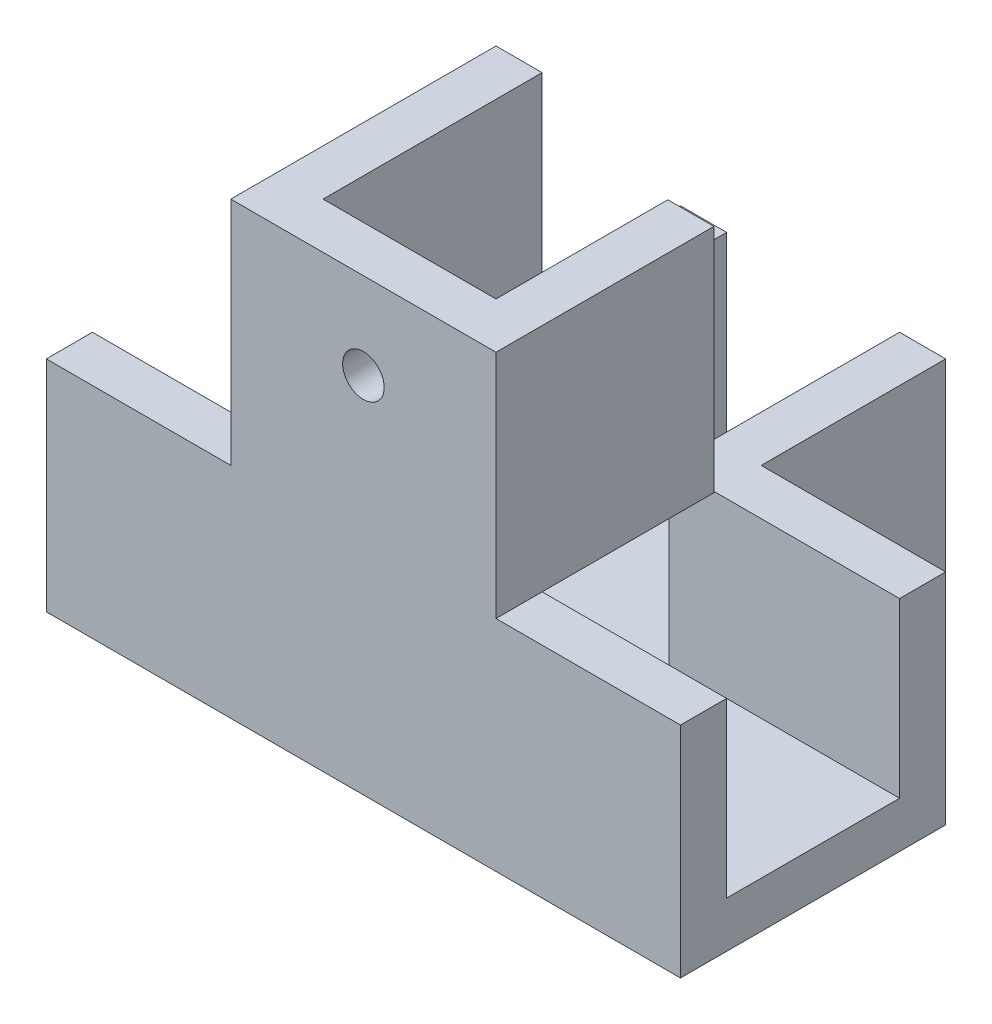
ISO-10303-21;
HEADER;
FILE_DESCRIPTION(('STEP AP214'),'2;1');
FILE_NAME('part.step','',(''),(''),'','','');
FILE_SCHEMA(('AUTOMOTIVE_DESIGN { 1 0 10303 214 1 1 1 1 }'));
ENDSEC;
DATA;
#1=APPLICATION_CONTEXT('core data for automotive mechanical design processes');
#2=APPLICATION_PROTOCOL_DEFINITION('international standard','automotive_design',2000,#1);
#3=PRODUCT_CONTEXT('',#1,'mechanical');
#4=PRODUCT('Part','Part','',(#3));
#5=PRODUCT_RELATED_PRODUCT_CATEGORY('part','',(#4));
#6=PRODUCT_DEFINITION_FORMATION('','',#4);
#7=PRODUCT_DEFINITION_CONTEXT('part definition',#1,'design');
#8=PRODUCT_DEFINITION('design','',#6,#7);
#9=PRODUCT_DEFINITION_SHAPE('','',#8);
#10=(LENGTH_UNIT() NAMED_UNIT(*) SI_UNIT(.MILLI.,.METRE.));
#11=(NAMED_UNIT(*) PLANE_ANGLE_UNIT() SI_UNIT($,.RADIAN.));
#12=(NAMED_UNIT(*) SI_UNIT($,.STERADIAN.) SOLID_ANGLE_UNIT());
#13=UNCERTAINTY_MEASURE_WITH_UNIT(LENGTH_MEASURE(1.E-05),#10,'distance_accuracy_value','');
#14=(GEOMETRIC_REPRESENTATION_CONTEXT(3) GLOBAL_UNCERTAINTY_ASSIGNED_CONTEXT((#13)) GLOBAL_UNIT_ASSIGNED_CONTEXT((#10,
#11,#12)) REPRESENTATION_CONTEXT('',''));
#15=CARTESIAN_POINT('',(0.,0.,0.));
#16=DIRECTION('',(0.,0.,1.));
#17=DIRECTION('',(1.,0.,0.));
#18=AXIS2_PLACEMENT_3D('',#15,#16,#17);
#19=CARTESIAN_POINT('',(0.,15.,0.));
#20=DIRECTION('',(0.,1.,0.));
#21=DIRECTION('',(0.,0.,1.));
#22=AXIS2_PLACEMENT_3D('',#19,#20,#21);
#23=PLANE('',#22);
#24=DIRECTION('',(1.,0.,0.));
#25=VECTOR('',#24,1.);
#26=CARTESIAN_POINT('',(0.,15.,-11.7755102040816));
#27=LINE('',#26,#25);
#28=CARTESIAN_POINT('',(-24.7551020408163,15.,-11.7755102040816));
#29=VERTEX_POINT('',#28);
#30=CARTESIAN_POINT('',(-8.75510204081633,15.,-11.7755102040816));
#31=VERTEX_POINT('',#30);
#32=EDGE_CURVE('E374',#29,#31,#27,.T.);
#33=ORIENTED_EDGE('',*,*,#32,.T.);
#34=DIRECTION('',(0.,0.,1.));
#35=VECTOR('',#34,1.);
#36=CARTESIAN_POINT('',(-8.75510204081633,15.,-15.7755102040816));
#37=LINE('',#36,#35);
#38=CARTESIAN_POINT('',(-8.75510204081633,15.,-15.7755102040816));
#39=VERTEX_POINT('',#38);
#40=EDGE_CURVE('E491',#39,#31,#37,.T.);
#41=ORIENTED_EDGE('',*,*,#40,.F.);
#42=DIRECTION('',(1.,0.,0.));
#43=VECTOR('',#42,1.);
#44=CARTESIAN_POINT('',(0.,15.,-15.7755102040816));
#45=LINE('',#44,#43);
#46=CARTESIAN_POINT('',(-24.7551020408163,15.,-15.7755102040816));
#47=VERTEX_POINT('',#46);
#48=EDGE_CURVE('E390',#47,#39,#45,.T.);
#49=ORIENTED_EDGE('',*,*,#48,.F.);
#50=DIRECTION('',(0.,0.,1.));
#51=VECTOR('',#50,1.);
#52=CARTESIAN_POINT('',(-24.7551020408163,15.,0.));
#53=LINE('',#52,#51);
#54=EDGE_CURVE('E394',#47,#29,#53,.T.);
#55=ORIENTED_EDGE('',*,*,#54,.T.);
#56=EDGE_LOOP('',(#33,#41,#49,#55));
#57=FACE_BOUND('',#56,.T.);
#58=ADVANCED_FACE('F41',(#57),#23,.T.);
#59=DIRECTION('',(0.,0.,-1.));
#60=VECTOR('',#59,1.);
#61=CARTESIAN_POINT('',(-8.75510204081633,15.,0.));
#62=LINE('',#61,#60);
#63=CARTESIAN_POINT('',(-8.75510204081633,15.,-31.7755102040816));
#64=VERTEX_POINT('',#63);
#65=EDGE_CURVE('E386',#39,#64,#62,.T.);
#66=ORIENTED_EDGE('',*,*,#65,.F.);
#67=DIRECTION('',(-1.,0.,0.));
#68=VECTOR('',#67,1.);
#69=CARTESIAN_POINT('',(-8.75510204081633,15.,-15.7755102040816));
#70=LINE('',#69,#68);
#71=CARTESIAN_POINT('',(-4.75510204081633,15.,-15.7755102040816));
#72=VERTEX_POINT('',#71);
#73=EDGE_CURVE('E236',#72,#39,#70,.T.);
#74=ORIENTED_EDGE('',*,*,#73,.F.);
#75=DIRECTION('',(0.,0.,-1.));
#76=VECTOR('',#75,1.);
#77=CARTESIAN_POINT('',(-4.75510204081633,15.,0.));
#78=LINE('',#77,#76);
#79=CARTESIAN_POINT('',(-4.75510204081633,15.,-31.7755102040816));
#80=VERTEX_POINT('',#79);
#81=EDGE_CURVE('E378',#72,#80,#78,.T.);
#82=ORIENTED_EDGE('',*,*,#81,.T.);
#83=DIRECTION('',(1.,0.,0.));
#84=VECTOR('',#83,1.);
#85=CARTESIAN_POINT('',(0.,15.,-31.7755102040816));
#86=LINE('',#85,#84);
#87=EDGE_CURVE('E382',#64,#80,#86,.T.);
#88=ORIENTED_EDGE('',*,*,#87,.F.);
#89=EDGE_LOOP('',(#66,#74,#82,#88));
#90=FACE_BOUND('',#89,.T.);
#91=ADVANCED_FACE('F446',(#90),#23,.T.);
#92=CARTESIAN_POINT('',(0.,15.,0.));
#93=DIRECTION('',(0.,1.,0.));
#94=DIRECTION('',(0.,0.,1.));
#95=AXIS2_PLACEMENT_3D('',#92,#93,#94);
#96=PLANE('',#95);
#97=DIRECTION('',(1.,0.,0.));
#98=VECTOR('',#97,1.);
#99=CARTESIAN_POINT('',(0.,15.,7.22448979591837));
#100=LINE('',#99,#98);
#101=CARTESIAN_POINT('',(-24.7551020408163,15.,7.22448979591837));
#102=VERTEX_POINT('',#101);
#103=CARTESIAN_POINT('',(-8.75510204081633,15.,7.22448979591837));
#104=VERTEX_POINT('',#103);
#105=EDGE_CURVE('E267',#102,#104,#100,.T.);
#106=ORIENTED_EDGE('',*,*,#105,.T.);
#107=DIRECTION('',(0.,0.,-1.));
#108=VECTOR('',#107,1.);
#109=CARTESIAN_POINT('',(-8.75510204081633,15.,0.));
#110=LINE('',#109,#108);
#111=CARTESIAN_POINT('',(-8.75510204081633,15.,3.22448979591837));
#112=VERTEX_POINT('',#111);
#113=EDGE_CURVE('E11',#104,#112,#110,.T.);
#114=ORIENTED_EDGE('',*,*,#113,.T.);
#115=DIRECTION('',(1.,0.,0.));
#116=VECTOR('',#115,1.);
#117=CARTESIAN_POINT('',(0.,15.,3.22448979591837));
#118=LINE('',#117,#116);
#119=CARTESIAN_POINT('',(-24.7551020408163,15.,3.22448979591837));
#120=VERTEX_POINT('',#119);
#121=EDGE_CURVE('E257',#120,#112,#118,.T.);
#122=ORIENTED_EDGE('',*,*,#121,.F.);
#123=DIRECTION('',(0.,0.,1.));
#124=VECTOR('',#123,1.);
#125=CARTESIAN_POINT('',(-24.7551020408163,15.,0.));
#126=LINE('',#125,#124);
#127=EDGE_CURVE('E261',#120,#102,#126,.T.);
#128=ORIENTED_EDGE('',*,*,#127,.T.);
#129=EDGE_LOOP('',(#106,#114,#122,#128));
#130=FACE_BOUND('',#129,.T.);
#131=ADVANCED_FACE('F597',(#130),#96,.T.);
#132=CARTESIAN_POINT('',(14.2448979591837,15.,3.22448979591837));
#133=VERTEX_POINT('',#132);
#134=CARTESIAN_POINT('',(30.2448979591837,15.,3.22448979591837));
#135=VERTEX_POINT('',#134);
#136=EDGE_CURVE('E256',#133,#135,#118,.T.);
#137=ORIENTED_EDGE('',*,*,#136,.F.);
#138=DIRECTION('',(0.,0.,-1.));
#139=VECTOR('',#138,1.);
#140=CARTESIAN_POINT('',(14.2448979591837,15.,-11.6755102040816));
#141=LINE('',#140,#139);
#142=CARTESIAN_POINT('',(14.2448979591837,15.,7.22448979591837));
#143=VERTEX_POINT('',#142);
#144=EDGE_CURVE('E485',#143,#133,#141,.T.);
#145=ORIENTED_EDGE('',*,*,#144,.F.);
#146=CARTESIAN_POINT('',(30.2448979591837,15.,7.22448979591837));
#147=VERTEX_POINT('',#146);
#148=EDGE_CURVE('E266',#143,#147,#100,.T.);
#149=ORIENTED_EDGE('',*,*,#148,.T.);
#150=DIRECTION('',(0.,0.,1.));
#151=VECTOR('',#150,1.);
#152=CARTESIAN_POINT('',(30.2448979591837,15.,0.));
#153=LINE('',#152,#151);
#154=EDGE_CURVE('E252',#135,#147,#153,.T.);
#155=ORIENTED_EDGE('',*,*,#154,.F.);
#156=EDGE_LOOP('',(#137,#145,#149,#155));
#157=FACE_BOUND('',#156,.T.);
#158=ADVANCED_FACE('F589',(#157),#96,.T.);
#159=CARTESIAN_POINT('',(0.,0.,0.));
#160=DIRECTION('',(0.,-1.,0.));
#161=DIRECTION('',(0.,0.,-1.));
#162=AXIS2_PLACEMENT_3D('',#159,#160,#161);
#163=PLANE('',#162);
#164=CARTESIAN_POINT('',(2.74489795918367,0.,-24.2755102040816));
#165=DIRECTION('',(0.,-1.,0.));
#166=DIRECTION('',(0.,0.,-1.));
#167=AXIS2_PLACEMENT_3D('',#164,#165,#166);
#168=CIRCLE('',#167,1.8);
#169=CARTESIAN_POINT('',(2.74489795918367,0.,-26.0755102040816));
#170=VERTEX_POINT('',#169);
#171=EDGE_CURVE('E510',#170,#170,#168,.T.);
#172=ORIENTED_EDGE('',*,*,#171,.T.);
#173=EDGE_LOOP('',(#172));
#174=FACE_BOUND('',#173,.T.);
#175=CARTESIAN_POINT('',(2.74489795918367,0.,-4.27551020408163));
#176=DIRECTION('',(0.,-1.,0.));
#177=DIRECTION('',(0.,0.,-1.));
#178=AXIS2_PLACEMENT_3D('',#175,#176,#177);
#179=CIRCLE('',#178,1.8);
#180=CARTESIAN_POINT('',(2.74489795918367,0.,-6.07551020408163));
#181=VERTEX_POINT('',#180);
#182=EDGE_CURVE('E514',#181,#181,#179,.T.);
#183=ORIENTED_EDGE('',*,*,#182,.T.);
#184=EDGE_LOOP('',(#183));
#185=FACE_BOUND('',#184,.T.);
#186=DIRECTION('',(0.,0.,-1.));
#187=VECTOR('',#186,1.);
#188=CARTESIAN_POINT('',(-24.7551020408163,0.,-15.7755102040816));
#189=LINE('',#188,#187);
#190=CARTESIAN_POINT('',(-24.7551020408163,0.,3.22448979591837));
#191=VERTEX_POINT('',#190);
#192=CARTESIAN_POINT('',(-24.7551020408163,0.,-11.7755102040816));
#193=VERTEX_POINT('',#192);
#194=EDGE_CURVE('E353',#191,#193,#189,.T.);
#195=ORIENTED_EDGE('',*,*,#194,.F.);
#196=DIRECTION('',(1.,0.,0.));
#197=VECTOR('',#196,1.);
#198=CARTESIAN_POINT('',(0.,0.,3.22448979591837));
#199=LINE('',#198,#197);
#200=CARTESIAN_POINT('',(30.2448979591837,0.,3.22448979591837));
#201=VERTEX_POINT('',#200);
#202=EDGE_CURVE('E246',#191,#201,#199,.T.);
#203=ORIENTED_EDGE('',*,*,#202,.T.);
#204=DIRECTION('',(0.,0.,1.));
#205=VECTOR('',#204,1.);
#206=CARTESIAN_POINT('',(30.2448979591837,0.,-15.7755102040816));
#207=LINE('',#206,#205);
#208=CARTESIAN_POINT('',(30.2448979591837,0.,-11.7755102040816));
#209=VERTEX_POINT('',#208);
#210=EDGE_CURVE('E319',#209,#201,#207,.T.);
#211=ORIENTED_EDGE('',*,*,#210,.F.);
#212=DIRECTION('',(1.,0.,0.));
#213=VECTOR('',#212,1.);
#214=CARTESIAN_POINT('',(0.,0.,-11.7755102040816));
#215=LINE('',#214,#213);
#216=CARTESIAN_POINT('',(10.2448979591837,0.,-11.7755102040816));
#217=VERTEX_POINT('',#216);
#218=EDGE_CURVE('E279',#217,#209,#215,.T.);
#219=ORIENTED_EDGE('',*,*,#218,.F.);
#220=DIRECTION('',(0.,0.,-1.));
#221=VECTOR('',#220,1.);
#222=CARTESIAN_POINT('',(10.2448979591837,0.,0.));
#223=LINE('',#222,#221);
#224=CARTESIAN_POINT('',(10.2448979591837,0.,-31.7755102040816));
#225=VERTEX_POINT('',#224);
#226=EDGE_CURVE('E284',#217,#225,#223,.T.);
#227=ORIENTED_EDGE('',*,*,#226,.T.);
#228=DIRECTION('',(1.,0.,0.));
#229=VECTOR('',#228,1.);
#230=CARTESIAN_POINT('',(14.2448979591837,0.,-31.7755102040816));
#231=LINE('',#230,#229);
#232=CARTESIAN_POINT('',(-4.75510204081633,0.,-31.7755102040816));
#233=VERTEX_POINT('',#232);
#234=EDGE_CURVE('E325',#233,#225,#231,.T.);
#235=ORIENTED_EDGE('',*,*,#234,.F.);
#236=DIRECTION('',(0.,0.,-1.));
#237=VECTOR('',#236,1.);
#238=CARTESIAN_POINT('',(-4.75510204081633,0.,0.));
#239=LINE('',#238,#237);
#240=CARTESIAN_POINT('',(-4.75510204081633,0.,-11.7755102040816));
#241=VERTEX_POINT('',#240);
#242=EDGE_CURVE('E379',#241,#233,#239,.T.);
#243=ORIENTED_EDGE('',*,*,#242,.F.);
#244=DIRECTION('',(1.,0.,0.));
#245=VECTOR('',#244,1.);
#246=CARTESIAN_POINT('',(0.,0.,-11.7755102040816));
#247=LINE('',#246,#245);
#248=EDGE_CURVE('E373',#193,#241,#247,.T.);
#249=ORIENTED_EDGE('',*,*,#248,.F.);
#250=EDGE_LOOP('',(#195,#203,#211,#219,#227,#235,#243,#249));
#251=FACE_BOUND('',#250,.T.);
#252=ADVANCED_FACE('F436',(#174,#185,#251),#163,.F.);
#253=CARTESIAN_POINT('',(0.,15.,-11.7755102040816));
#254=DIRECTION('',(0.,0.,-1.));
#255=DIRECTION('',(-1.,0.,0.));
#256=AXIS2_PLACEMENT_3D('',#253,#254,#255);
#257=PLANE('',#256);
#258=ORIENTED_EDGE('',*,*,#248,.T.);
#259=DIRECTION('',(0.,-1.,0.));
#260=VECTOR('',#259,1.);
#261=CARTESIAN_POINT('',(-4.75510204081633,15.,-11.7755102040816));
#262=LINE('',#261,#260);
#263=CARTESIAN_POINT('',(-4.75510204081633,15.,-11.7755102040816));
#264=VERTEX_POINT('',#263);
#265=EDGE_CURVE('E51',#264,#241,#262,.T.);
#266=ORIENTED_EDGE('',*,*,#265,.F.);
#267=DIRECTION('',(1.,0.,0.));
#268=VECTOR('',#267,1.);
#269=CARTESIAN_POINT('',(0.,15.,-11.7755102040816));
#270=LINE('',#269,#268);
#271=EDGE_CURVE('E242',#31,#264,#270,.T.);
#272=ORIENTED_EDGE('',*,*,#271,.F.);
#273=ORIENTED_EDGE('',*,*,#32,.F.);
#274=DIRECTION('',(0.,-1.,0.));
#275=VECTOR('',#274,1.);
#276=CARTESIAN_POINT('',(-24.7551020408163,15.,-11.7755102040816));
#277=LINE('',#276,#275);
#278=EDGE_CURVE('E397',#29,#193,#277,.T.);
#279=ORIENTED_EDGE('',*,*,#278,.T.);
#280=EDGE_LOOP('',(#258,#266,#272,#273,#279));
#281=FACE_BOUND('',#280,.T.);
#282=ADVANCED_FACE('F43',(#281),#257,.F.);
#283=CARTESIAN_POINT('',(-4.75510204081633,15.,0.));
#284=DIRECTION('',(-1.,0.,0.));
#285=DIRECTION('',(0.,0.,1.));
#286=AXIS2_PLACEMENT_3D('',#283,#284,#285);
#287=PLANE('',#286);
#288=ORIENTED_EDGE('',*,*,#242,.T.);
#289=DIRECTION('',(0.,-1.,0.));
#290=VECTOR('',#289,1.);
#291=CARTESIAN_POINT('',(-4.75510204081633,15.,-31.7755102040816));
#292=LINE('',#291,#290);
#293=EDGE_CURVE('E416',#80,#233,#292,.T.);
#294=ORIENTED_EDGE('',*,*,#293,.F.);
#295=ORIENTED_EDGE('',*,*,#81,.F.);
#296=DIRECTION('',(0.,-1.,0.));
#297=VECTOR('',#296,1.);
#298=CARTESIAN_POINT('',(-4.75510204081633,35.,-15.7755102040816));
#299=LINE('',#298,#297);
#300=CARTESIAN_POINT('',(-4.75510204081633,35.,-15.7755102040816));
#301=VERTEX_POINT('',#300);
#302=EDGE_CURVE('E58',#301,#72,#299,.T.);
#303=ORIENTED_EDGE('',*,*,#302,.F.);
#304=DIRECTION('',(0.,0.,-1.));
#305=VECTOR('',#304,1.);
#306=CARTESIAN_POINT('',(-4.75510204081633,35.,-15.7755102040816));
#307=LINE('',#306,#305);
#308=CARTESIAN_POINT('',(-4.75510204081632,35.,3.22448979591837));
#309=VERTEX_POINT('',#308);
#310=EDGE_CURVE('E497',#309,#301,#307,.T.);
#311=ORIENTED_EDGE('',*,*,#310,.F.);
#312=DIRECTION('',(0.,-1.,0.));
#313=VECTOR('',#312,1.);
#314=CARTESIAN_POINT('',(-4.75510204081632,35.,3.22448979591837));
#315=LINE('',#314,#313);
#316=CARTESIAN_POINT('',(-4.75510204081632,15.,3.22448979591837));
#317=VERTEX_POINT('',#316);
#318=EDGE_CURVE('E459',#309,#317,#315,.T.);
#319=ORIENTED_EDGE('',*,*,#318,.T.);
#320=DIRECTION('',(0.,0.,-1.));
#321=VECTOR('',#320,1.);
#322=CARTESIAN_POINT('',(-4.75510204081633,15.,-15.7755102040816));
#323=LINE('',#322,#321);
#324=EDGE_CURVE('E428',#317,#264,#323,.T.);
#325=ORIENTED_EDGE('',*,*,#324,.T.);
#326=ORIENTED_EDGE('',*,*,#265,.T.);
#327=EDGE_LOOP('',(#288,#294,#295,#303,#311,#319,#325,#326));
#328=FACE_BOUND('',#327,.T.);
#329=ADVANCED_FACE('F425',(#328),#287,.F.);
#330=CARTESIAN_POINT('',(0.,15.,-31.7755102040816));
#331=DIRECTION('',(0.,0.,-1.));
#332=DIRECTION('',(-1.,0.,0.));
#333=AXIS2_PLACEMENT_3D('',#330,#331,#332);
#334=PLANE('',#333);
#335=ORIENTED_EDGE('',*,*,#293,.T.);
#336=ORIENTED_EDGE('',*,*,#234,.T.);
#337=DIRECTION('',(0.,-1.,0.));
#338=VECTOR('',#337,1.);
#339=CARTESIAN_POINT('',(10.2448979591837,15.,-31.7755102040816));
#340=LINE('',#339,#338);
#341=CARTESIAN_POINT('',(10.2448979591837,15.,-31.7755102040816));
#342=VERTEX_POINT('',#341);
#343=EDGE_CURVE('E313',#342,#225,#340,.T.);
#344=ORIENTED_EDGE('',*,*,#343,.F.);
#345=DIRECTION('',(1.,0.,0.));
#346=VECTOR('',#345,1.);
#347=CARTESIAN_POINT('',(0.,15.,-31.7755102040816));
#348=LINE('',#347,#346);
#349=CARTESIAN_POINT('',(14.2448979591837,15.,-31.7755102040816));
#350=VERTEX_POINT('',#349);
#351=EDGE_CURVE('E296',#342,#350,#348,.T.);
#352=ORIENTED_EDGE('',*,*,#351,.T.);
#353=DIRECTION('',(0.,1.,0.));
#354=VECTOR('',#353,1.);
#355=CARTESIAN_POINT('',(14.2448979591837,-4.,-31.7755102040816));
#356=LINE('',#355,#354);
#357=CARTESIAN_POINT('',(14.2448979591837,-4.,-31.7755102040816));
#358=VERTEX_POINT('',#357);
#359=EDGE_CURVE('E364',#358,#350,#356,.T.);
#360=ORIENTED_EDGE('',*,*,#359,.F.);
#361=DIRECTION('',(1.,0.,0.));
#362=VECTOR('',#361,1.);
#363=CARTESIAN_POINT('',(14.2448979591837,-4.,-31.7755102040816));
#364=LINE('',#363,#362);
#365=CARTESIAN_POINT('',(-8.75510204081633,-4.,-31.7755102040816));
#366=VERTEX_POINT('',#365);
#367=EDGE_CURVE('E340',#366,#358,#364,.T.);
#368=ORIENTED_EDGE('',*,*,#367,.F.);
#369=DIRECTION('',(0.,-1.,0.));
#370=VECTOR('',#369,1.);
#371=CARTESIAN_POINT('',(-8.75510204081633,15.,-31.7755102040816));
#372=LINE('',#371,#370);
#373=EDGE_CURVE('E413',#64,#366,#372,.T.);
#374=ORIENTED_EDGE('',*,*,#373,.F.);
#375=ORIENTED_EDGE('',*,*,#87,.T.);
#376=EDGE_LOOP('',(#335,#336,#344,#352,#360,#368,#374,#375));
#377=FACE_BOUND('',#376,.T.);
#378=ADVANCED_FACE('F440',(#377),#334,.T.);
#379=CARTESIAN_POINT('',(-8.75510204081633,15.,0.));
#380=DIRECTION('',(-1.,0.,0.));
#381=DIRECTION('',(0.,0.,1.));
#382=AXIS2_PLACEMENT_3D('',#379,#380,#381);
#383=PLANE('',#382);
#384=ORIENTED_EDGE('',*,*,#373,.T.);
#385=DIRECTION('',(0.,0.,-1.));
#386=VECTOR('',#385,1.);
#387=CARTESIAN_POINT('',(-8.75510204081633,-4.,-31.7755102040816));
#388=LINE('',#387,#386);
#389=CARTESIAN_POINT('',(-8.75510204081633,-4.,-15.7755102040816));
#390=VERTEX_POINT('',#389);
#391=EDGE_CURVE('E336',#390,#366,#388,.T.);
#392=ORIENTED_EDGE('',*,*,#391,.F.);
#393=DIRECTION('',(0.,-1.,0.));
#394=VECTOR('',#393,1.);
#395=CARTESIAN_POINT('',(-8.75510204081633,15.,-15.7755102040816));
#396=LINE('',#395,#394);
#397=EDGE_CURVE('E410',#39,#390,#396,.T.);
#398=ORIENTED_EDGE('',*,*,#397,.F.);
#399=ORIENTED_EDGE('',*,*,#65,.T.);
#400=EDGE_LOOP('',(#384,#392,#398,#399));
#401=FACE_BOUND('',#400,.T.);
#402=ADVANCED_FACE('F574',(#401),#383,.T.);
#403=CARTESIAN_POINT('',(0.,15.,-15.7755102040816));
#404=DIRECTION('',(0.,0.,-1.));
#405=DIRECTION('',(-1.,0.,0.));
#406=AXIS2_PLACEMENT_3D('',#403,#404,#405);
#407=PLANE('',#406);
#408=ORIENTED_EDGE('',*,*,#397,.T.);
#409=DIRECTION('',(1.,0.,0.));
#410=VECTOR('',#409,1.);
#411=CARTESIAN_POINT('',(-8.75510204081633,-4.,-15.7755102040816));
#412=LINE('',#411,#410);
#413=CARTESIAN_POINT('',(-24.7551020408163,-4.,-15.7755102040816));
#414=VERTEX_POINT('',#413);
#415=EDGE_CURVE('E332',#414,#390,#412,.T.);
#416=ORIENTED_EDGE('',*,*,#415,.F.);
#417=DIRECTION('',(0.,-1.,0.));
#418=VECTOR('',#417,1.);
#419=CARTESIAN_POINT('',(-24.7551020408163,15.,-15.7755102040816));
#420=LINE('',#419,#418);
#421=EDGE_CURVE('E407',#47,#414,#420,.T.);
#422=ORIENTED_EDGE('',*,*,#421,.F.);
#423=ORIENTED_EDGE('',*,*,#48,.T.);
#424=EDGE_LOOP('',(#408,#416,#422,#423));
#425=FACE_BOUND('',#424,.T.);
#426=ADVANCED_FACE('F576',(#425),#407,.T.);
#427=CARTESIAN_POINT('',(-24.7551020408163,15.,0.));
#428=DIRECTION('',(1.,0.,0.));
#429=DIRECTION('',(0.,0.,-1.));
#430=AXIS2_PLACEMENT_3D('',#427,#428,#429);
#431=PLANE('',#430);
#432=ORIENTED_EDGE('',*,*,#421,.T.);
#433=DIRECTION('',(0.,0.,-1.));
#434=VECTOR('',#433,1.);
#435=CARTESIAN_POINT('',(-24.7551020408163,-4.,-15.7755102040816));
#436=LINE('',#435,#434);
#437=CARTESIAN_POINT('',(-24.7551020408163,-4.,7.22448979591837));
#438=VERTEX_POINT('',#437);
#439=EDGE_CURVE('E328',#438,#414,#436,.T.);
#440=ORIENTED_EDGE('',*,*,#439,.F.);
#441=DIRECTION('',(0.,1.,0.));
#442=VECTOR('',#441,1.);
#443=CARTESIAN_POINT('',(-24.7551020408163,-4.,7.22448979591837));
#444=LINE('',#443,#442);
#445=EDGE_CURVE('E367',#438,#102,#444,.T.);
#446=ORIENTED_EDGE('',*,*,#445,.T.);
#447=ORIENTED_EDGE('',*,*,#127,.F.);
#448=DIRECTION('',(0.,-1.,0.));
#449=VECTOR('',#448,1.);
#450=CARTESIAN_POINT('',(-24.7551020408163,15.,3.22448979591837));
#451=LINE('',#450,#449);
#452=EDGE_CURVE('E270',#120,#191,#451,.T.);
#453=ORIENTED_EDGE('',*,*,#452,.T.);
#454=ORIENTED_EDGE('',*,*,#194,.T.);
#455=ORIENTED_EDGE('',*,*,#278,.F.);
#456=ORIENTED_EDGE('',*,*,#54,.F.);
#457=EDGE_LOOP('',(#432,#440,#446,#447,#453,#454,#455,#456));
#458=FACE_BOUND('',#457,.T.);
#459=ADVANCED_FACE('F601',(#458),#431,.F.);
#460=CARTESIAN_POINT('',(30.2448979591837,-4.,-15.7755102040816));
#461=DIRECTION('',(-1.,0.,0.));
#462=DIRECTION('',(0.,0.,1.));
#463=AXIS2_PLACEMENT_3D('',#460,#461,#462);
#464=PLANE('',#463);
#465=DIRECTION('',(0.,1.,0.));
#466=VECTOR('',#465,1.);
#467=CARTESIAN_POINT('',(30.2448979591837,-4.,-15.7755102040816));
#468=LINE('',#467,#466);
#469=CARTESIAN_POINT('',(30.2448979591837,-4.,-15.7755102040816));
#470=VERTEX_POINT('',#469);
#471=CARTESIAN_POINT('',(30.2448979591837,15.,-15.7755102040816));
#472=VERTEX_POINT('',#471);
#473=EDGE_CURVE('E349',#470,#472,#468,.T.);
#474=ORIENTED_EDGE('',*,*,#473,.T.);
#475=DIRECTION('',(0.,0.,1.));
#476=VECTOR('',#475,1.);
#477=CARTESIAN_POINT('',(30.2448979591837,15.,0.));
#478=LINE('',#477,#476);
#479=CARTESIAN_POINT('',(30.2448979591837,15.,-11.7755102040816));
#480=VERTEX_POINT('',#479);
#481=EDGE_CURVE('E283',#472,#480,#478,.T.);
#482=ORIENTED_EDGE('',*,*,#481,.T.);
#483=DIRECTION('',(0.,-1.,0.));
#484=VECTOR('',#483,1.);
#485=CARTESIAN_POINT('',(30.2448979591837,15.,-11.7755102040816));
#486=LINE('',#485,#484);
#487=EDGE_CURVE('E316',#480,#209,#486,.T.);
#488=ORIENTED_EDGE('',*,*,#487,.T.);
#489=ORIENTED_EDGE('',*,*,#210,.T.);
#490=DIRECTION('',(0.,-1.,0.));
#491=VECTOR('',#490,1.);
#492=CARTESIAN_POINT('',(30.2448979591837,15.,3.22448979591837));
#493=LINE('',#492,#491);
#494=EDGE_CURVE('E276',#135,#201,#493,.T.);
#495=ORIENTED_EDGE('',*,*,#494,.F.);
#496=ORIENTED_EDGE('',*,*,#154,.T.);
#497=DIRECTION('',(0.,1.,0.));
#498=VECTOR('',#497,1.);
#499=CARTESIAN_POINT('',(30.2448979591837,-4.,7.22448979591837));
#500=LINE('',#499,#498);
#501=CARTESIAN_POINT('',(30.2448979591837,-4.,7.22448979591837));
#502=VERTEX_POINT('',#501);
#503=EDGE_CURVE('E370',#502,#147,#500,.T.);
#504=ORIENTED_EDGE('',*,*,#503,.F.);
#505=DIRECTION('',(0.,0.,1.));
#506=VECTOR('',#505,1.);
#507=CARTESIAN_POINT('',(30.2448979591837,-4.,-15.7755102040816));
#508=LINE('',#507,#506);
#509=EDGE_CURVE('E320',#470,#502,#508,.T.);
#510=ORIENTED_EDGE('',*,*,#509,.F.);
#511=EDGE_LOOP('',(#474,#482,#488,#489,#495,#496,#504,#510));
#512=FACE_BOUND('',#511,.T.);
#513=ADVANCED_FACE('F547',(#512),#464,.F.);
#514=CARTESIAN_POINT('',(30.2448979591837,-4.,7.22448979591837));
#515=DIRECTION('',(0.,0.,-1.));
#516=DIRECTION('',(-1.,0.,0.));
#517=AXIS2_PLACEMENT_3D('',#514,#515,#516);
#518=PLANE('',#517);
#519=CARTESIAN_POINT('',(2.74489795918367,27.5,7.22448979591837));
#520=DIRECTION('',(0.,0.,1.));
#521=DIRECTION('',(1.,0.,0.));
#522=AXIS2_PLACEMENT_3D('',#519,#520,#521);
#523=CIRCLE('',#522,1.8);
#524=CARTESIAN_POINT('',(4.54489795918367,27.5,7.22448979591837));
#525=VERTEX_POINT('',#524);
#526=EDGE_CURVE('E526',#525,#525,#523,.T.);
#527=ORIENTED_EDGE('',*,*,#526,.F.);
#528=EDGE_LOOP('',(#527));
#529=FACE_BOUND('',#528,.T.);
#530=ORIENTED_EDGE('',*,*,#503,.T.);
#531=ORIENTED_EDGE('',*,*,#148,.F.);
#532=DIRECTION('',(0.,-1.,0.));
#533=VECTOR('',#532,1.);
#534=CARTESIAN_POINT('',(14.2448979591837,35.,7.22448979591837));
#535=LINE('',#534,#533);
#536=CARTESIAN_POINT('',(14.2448979591837,35.,7.22448979591837));
#537=VERTEX_POINT('',#536);
#538=EDGE_CURVE('E222',#537,#143,#535,.T.);
#539=ORIENTED_EDGE('',*,*,#538,.F.);
#540=DIRECTION('',(1.,0.,0.));
#541=VECTOR('',#540,1.);
#542=CARTESIAN_POINT('',(-8.75510204081633,35.,7.22448979591837));
#543=LINE('',#542,#541);
#544=CARTESIAN_POINT('',(-8.75510204081633,35.,7.22448979591837));
#545=VERTEX_POINT('',#544);
#546=EDGE_CURVE('E213',#545,#537,#543,.T.);
#547=ORIENTED_EDGE('',*,*,#546,.F.);
#548=DIRECTION('',(0.,-1.,0.));
#549=VECTOR('',#548,1.);
#550=CARTESIAN_POINT('',(-8.75510204081633,35.,7.22448979591837));
#551=LINE('',#550,#549);
#552=EDGE_CURVE('E219',#545,#104,#551,.T.);
#553=ORIENTED_EDGE('',*,*,#552,.T.);
#554=ORIENTED_EDGE('',*,*,#105,.F.);
#555=ORIENTED_EDGE('',*,*,#445,.F.);
#556=DIRECTION('',(-1.,0.,0.));
#557=VECTOR('',#556,1.);
#558=CARTESIAN_POINT('',(30.2448979591837,-4.,7.22448979591837));
#559=LINE('',#558,#557);
#560=EDGE_CURVE('E324',#502,#438,#559,.T.);
#561=ORIENTED_EDGE('',*,*,#560,.F.);
#562=EDGE_LOOP('',(#530,#531,#539,#547,#553,#554,#555,#561));
#563=FACE_BOUND('',#562,.T.);
#564=ADVANCED_FACE('F216',(#529,#563),#518,.F.);
#565=CARTESIAN_POINT('',(14.2448979591837,-4.,-31.7755102040816));
#566=DIRECTION('',(-1.,0.,0.));
#567=DIRECTION('',(0.,0.,1.));
#568=AXIS2_PLACEMENT_3D('',#565,#566,#567);
#569=PLANE('',#568);
#570=ORIENTED_EDGE('',*,*,#359,.T.);
#571=DIRECTION('',(0.,0.,-1.));
#572=VECTOR('',#571,1.);
#573=CARTESIAN_POINT('',(14.2448979591837,15.,0.));
#574=LINE('',#573,#572);
#575=CARTESIAN_POINT('',(14.2448979591837,15.,-15.7755102040816));
#576=VERTEX_POINT('',#575);
#577=EDGE_CURVE('E292',#576,#350,#574,.T.);
#578=ORIENTED_EDGE('',*,*,#577,.F.);
#579=DIRECTION('',(0.,1.,0.));
#580=VECTOR('',#579,1.);
#581=CARTESIAN_POINT('',(14.2448979591837,-4.,-15.7755102040816));
#582=LINE('',#581,#580);
#583=CARTESIAN_POINT('',(14.2448979591837,-4.,-15.7755102040816));
#584=VERTEX_POINT('',#583);
#585=EDGE_CURVE('E361',#584,#576,#582,.T.);
#586=ORIENTED_EDGE('',*,*,#585,.F.);
#587=DIRECTION('',(0.,0.,1.));
#588=VECTOR('',#587,1.);
#589=CARTESIAN_POINT('',(14.2448979591837,-4.,-31.7755102040816));
#590=LINE('',#589,#588);
#591=EDGE_CURVE('E343',#358,#584,#590,.T.);
#592=ORIENTED_EDGE('',*,*,#591,.F.);
#593=EDGE_LOOP('',(#570,#578,#586,#592));
#594=FACE_BOUND('',#593,.T.);
#595=ADVANCED_FACE('F564',(#594),#569,.F.);
#596=CARTESIAN_POINT('',(30.2448979591837,-4.,-15.7755102040816));
#597=DIRECTION('',(0.,0.,1.));
#598=DIRECTION('',(1.,0.,0.));
#599=AXIS2_PLACEMENT_3D('',#596,#597,#598);
#600=PLANE('',#599);
#601=ORIENTED_EDGE('',*,*,#585,.T.);
#602=DIRECTION('',(1.,0.,0.));
#603=VECTOR('',#602,1.);
#604=CARTESIAN_POINT('',(0.,15.,-15.7755102040816));
#605=LINE('',#604,#603);
#606=EDGE_CURVE('E288',#576,#472,#605,.T.);
#607=ORIENTED_EDGE('',*,*,#606,.T.);
#608=ORIENTED_EDGE('',*,*,#473,.F.);
#609=DIRECTION('',(1.,0.,0.));
#610=VECTOR('',#609,1.);
#611=CARTESIAN_POINT('',(30.2448979591837,-4.,-15.7755102040816));
#612=LINE('',#611,#610);
#613=EDGE_CURVE('E346',#584,#470,#612,.T.);
#614=ORIENTED_EDGE('',*,*,#613,.F.);
#615=EDGE_LOOP('',(#601,#607,#608,#614));
#616=FACE_BOUND('',#615,.T.);
#617=ADVANCED_FACE('F607',(#616),#600,.F.);
#618=CARTESIAN_POINT('',(0.,-4.,0.));
#619=DIRECTION('',(0.,-1.,0.));
#620=DIRECTION('',(0.,0.,-1.));
#621=AXIS2_PLACEMENT_3D('',#618,#619,#620);
#622=PLANE('',#621);
#623=CARTESIAN_POINT('',(2.74489795918367,-4.,-24.2755102040816));
#624=DIRECTION('',(0.,-1.,0.));
#625=DIRECTION('',(0.,0.,-1.));
#626=AXIS2_PLACEMENT_3D('',#623,#624,#625);
#627=CIRCLE('',#626,1.8);
#628=CARTESIAN_POINT('',(2.74489795918367,-4.,-26.0755102040816));
#629=VERTEX_POINT('',#628);
#630=EDGE_CURVE('E518',#629,#629,#627,.T.);
#631=ORIENTED_EDGE('',*,*,#630,.F.);
#632=EDGE_LOOP('',(#631));
#633=FACE_BOUND('',#632,.T.);
#634=CARTESIAN_POINT('',(2.74489795918367,-4.,-4.27551020408163));
#635=DIRECTION('',(0.,-1.,0.));
#636=DIRECTION('',(0.,0.,-1.));
#637=AXIS2_PLACEMENT_3D('',#634,#635,#636);
#638=CIRCLE('',#637,1.8);
#639=CARTESIAN_POINT('',(2.74489795918367,-4.,-6.07551020408163));
#640=VERTEX_POINT('',#639);
#641=EDGE_CURVE('E519',#640,#640,#638,.T.);
#642=ORIENTED_EDGE('',*,*,#641,.F.);
#643=EDGE_LOOP('',(#642));
#644=FACE_BOUND('',#643,.T.);
#645=ORIENTED_EDGE('',*,*,#509,.T.);
#646=ORIENTED_EDGE('',*,*,#560,.T.);
#647=ORIENTED_EDGE('',*,*,#439,.T.);
#648=ORIENTED_EDGE('',*,*,#415,.T.);
#649=ORIENTED_EDGE('',*,*,#391,.T.);
#650=ORIENTED_EDGE('',*,*,#367,.T.);
#651=ORIENTED_EDGE('',*,*,#591,.T.);
#652=ORIENTED_EDGE('',*,*,#613,.T.);
#653=EDGE_LOOP('',(#645,#646,#647,#648,#649,#650,#651,#652));
#654=FACE_BOUND('',#653,.T.);
#655=ADVANCED_FACE('F569',(#633,#644,#654),#622,.T.);
#656=CARTESIAN_POINT('',(0.,15.,-11.7755102040816));
#657=DIRECTION('',(0.,0.,-1.));
#658=DIRECTION('',(-1.,0.,0.));
#659=AXIS2_PLACEMENT_3D('',#656,#657,#658);
#660=PLANE('',#659);
#661=ORIENTED_EDGE('',*,*,#218,.T.);
#662=ORIENTED_EDGE('',*,*,#487,.F.);
#663=DIRECTION('',(1.,0.,0.));
#664=VECTOR('',#663,1.);
#665=CARTESIAN_POINT('',(0.,15.,-11.7755102040816));
#666=LINE('',#665,#664);
#667=CARTESIAN_POINT('',(10.2448979591837,15.,-11.7755102040816));
#668=VERTEX_POINT('',#667);
#669=EDGE_CURVE('E280',#668,#480,#666,.T.);
#670=ORIENTED_EDGE('',*,*,#669,.F.);
#671=DIRECTION('',(0.,-1.,0.));
#672=VECTOR('',#671,1.);
#673=CARTESIAN_POINT('',(10.2448979591837,15.,-11.7755102040816));
#674=LINE('',#673,#672);
#675=EDGE_CURVE('E304',#668,#217,#674,.T.);
#676=ORIENTED_EDGE('',*,*,#675,.T.);
#677=EDGE_LOOP('',(#661,#662,#670,#676));
#678=FACE_BOUND('',#677,.T.);
#679=ADVANCED_FACE('F553',(#678),#660,.F.);
#680=CARTESIAN_POINT('',(10.2448979591837,15.,0.));
#681=DIRECTION('',(-1.,0.,0.));
#682=DIRECTION('',(0.,0.,1.));
#683=AXIS2_PLACEMENT_3D('',#680,#681,#682);
#684=PLANE('',#683);
#685=ORIENTED_EDGE('',*,*,#226,.F.);
#686=ORIENTED_EDGE('',*,*,#675,.F.);
#687=DIRECTION('',(0.,0.,-1.));
#688=VECTOR('',#687,1.);
#689=CARTESIAN_POINT('',(10.2448979591837,15.,0.));
#690=LINE('',#689,#688);
#691=EDGE_CURVE('E300',#668,#342,#690,.T.);
#692=ORIENTED_EDGE('',*,*,#691,.T.);
#693=ORIENTED_EDGE('',*,*,#343,.T.);
#694=EDGE_LOOP('',(#685,#686,#692,#693));
#695=FACE_BOUND('',#694,.T.);
#696=ADVANCED_FACE('F556',(#695),#684,.T.);
#697=CARTESIAN_POINT('',(0.,15.,0.));
#698=DIRECTION('',(0.,1.,0.));
#699=DIRECTION('',(0.,0.,1.));
#700=AXIS2_PLACEMENT_3D('',#697,#698,#699);
#701=PLANE('',#700);
#702=ORIENTED_EDGE('',*,*,#669,.T.);
#703=ORIENTED_EDGE('',*,*,#481,.F.);
#704=ORIENTED_EDGE('',*,*,#606,.F.);
#705=ORIENTED_EDGE('',*,*,#577,.T.);
#706=ORIENTED_EDGE('',*,*,#351,.F.);
#707=ORIENTED_EDGE('',*,*,#691,.F.);
#708=EDGE_LOOP('',(#702,#703,#704,#705,#706,#707));
#709=FACE_BOUND('',#708,.T.);
#710=ADVANCED_FACE('F540',(#709),#701,.T.);
#711=CARTESIAN_POINT('',(0.,15.,3.22448979591837));
#712=DIRECTION('',(0.,0.,-1.));
#713=DIRECTION('',(-1.,0.,0.));
#714=AXIS2_PLACEMENT_3D('',#711,#712,#713);
#715=PLANE('',#714);
#716=CARTESIAN_POINT('',(2.74489795918367,27.5,3.22448979591837));
#717=DIRECTION('',(0.,0.,-1.));
#718=DIRECTION('',(-1.,0.,0.));
#719=AXIS2_PLACEMENT_3D('',#716,#717,#718);
#720=CIRCLE('',#719,1.8);
#721=CARTESIAN_POINT('',(0.944897959183673,27.5,3.22448979591837));
#722=VERTEX_POINT('',#721);
#723=EDGE_CURVE('E45',#722,#722,#720,.T.);
#724=ORIENTED_EDGE('',*,*,#723,.F.);
#725=EDGE_LOOP('',(#724));
#726=FACE_BOUND('',#725,.T.);
#727=ORIENTED_EDGE('',*,*,#202,.F.);
#728=ORIENTED_EDGE('',*,*,#452,.F.);
#729=ORIENTED_EDGE('',*,*,#121,.T.);
#730=EDGE_CURVE('E262',#112,#317,#118,.T.);
#731=ORIENTED_EDGE('',*,*,#730,.T.);
#732=ORIENTED_EDGE('',*,*,#318,.F.);
#733=DIRECTION('',(-1.,0.,0.));
#734=VECTOR('',#733,1.);
#735=CARTESIAN_POINT('',(10.2448979591837,35.,3.22448979591837));
#736=LINE('',#735,#734);
#737=CARTESIAN_POINT('',(10.2448979591837,35.,3.22448979591837));
#738=VERTEX_POINT('',#737);
#739=EDGE_CURVE('E500',#738,#309,#736,.T.);
#740=ORIENTED_EDGE('',*,*,#739,.F.);
#741=DIRECTION('',(0.,-1.,0.));
#742=VECTOR('',#741,1.);
#743=CARTESIAN_POINT('',(10.2448979591837,35.,3.22448979591837));
#744=LINE('',#743,#742);
#745=CARTESIAN_POINT('',(10.2448979591837,15.,3.22448979591837));
#746=VERTEX_POINT('',#745);
#747=EDGE_CURVE('E66',#738,#746,#744,.T.);
#748=ORIENTED_EDGE('',*,*,#747,.T.);
#749=EDGE_CURVE('E591',#746,#133,#118,.T.);
#750=ORIENTED_EDGE('',*,*,#749,.T.);
#751=ORIENTED_EDGE('',*,*,#136,.T.);
#752=ORIENTED_EDGE('',*,*,#494,.T.);
#753=EDGE_LOOP('',(#727,#728,#729,#731,#732,#740,#748,#750,#751,#752));
#754=FACE_BOUND('',#753,.T.);
#755=ADVANCED_FACE('F537',(#726,#754),#715,.T.);
#756=CARTESIAN_POINT('',(0.,15.,0.));
#757=DIRECTION('',(0.,1.,0.));
#758=DIRECTION('',(0.,0.,1.));
#759=AXIS2_PLACEMENT_3D('',#756,#757,#758);
#760=PLANE('',#759);
#761=EDGE_CURVE('E494',#31,#112,#37,.T.);
#762=ORIENTED_EDGE('',*,*,#761,.F.);
#763=ORIENTED_EDGE('',*,*,#271,.T.);
#764=ORIENTED_EDGE('',*,*,#324,.F.);
#765=ORIENTED_EDGE('',*,*,#730,.F.);
#766=EDGE_LOOP('',(#762,#763,#764,#765));
#767=FACE_BOUND('',#766,.T.);
#768=ADVANCED_FACE('F539',(#767),#760,.F.);
#769=CARTESIAN_POINT('',(-8.75510204081633,35.,-15.7755102040816));
#770=DIRECTION('',(1.,0.,0.));
#771=DIRECTION('',(0.,0.,-1.));
#772=AXIS2_PLACEMENT_3D('',#769,#770,#771);
#773=PLANE('',#772);
#774=ORIENTED_EDGE('',*,*,#40,.T.);
#775=ORIENTED_EDGE('',*,*,#761,.T.);
#776=ORIENTED_EDGE('',*,*,#113,.F.);
#777=ORIENTED_EDGE('',*,*,#552,.F.);
#778=DIRECTION('',(0.,0.,1.));
#779=VECTOR('',#778,1.);
#780=CARTESIAN_POINT('',(-8.75510204081633,35.,-15.7755102040816));
#781=LINE('',#780,#779);
#782=CARTESIAN_POINT('',(-8.75510204081633,35.,-15.7755102040816));
#783=VERTEX_POINT('',#782);
#784=EDGE_CURVE('E227',#783,#545,#781,.T.);
#785=ORIENTED_EDGE('',*,*,#784,.F.);
#786=DIRECTION('',(0.,-1.,0.));
#787=VECTOR('',#786,1.);
#788=CARTESIAN_POINT('',(-8.75510204081633,35.,-15.7755102040816));
#789=LINE('',#788,#787);
#790=EDGE_CURVE('E454',#783,#39,#789,.T.);
#791=ORIENTED_EDGE('',*,*,#790,.T.);
#792=EDGE_LOOP('',(#774,#775,#776,#777,#785,#791));
#793=FACE_BOUND('',#792,.T.);
#794=ADVANCED_FACE('F239',(#793),#773,.F.);
#795=CARTESIAN_POINT('',(14.2448979591837,35.,-11.6755102040816));
#796=DIRECTION('',(-1.,0.,0.));
#797=DIRECTION('',(0.,0.,1.));
#798=AXIS2_PLACEMENT_3D('',#795,#796,#797);
#799=PLANE('',#798);
#800=ORIENTED_EDGE('',*,*,#144,.T.);
#801=CARTESIAN_POINT('',(14.2448979591837,15.,-11.6755102040816));
#802=VERTEX_POINT('',#801);
#803=EDGE_CURVE('E482',#133,#802,#141,.T.);
#804=ORIENTED_EDGE('',*,*,#803,.T.);
#805=DIRECTION('',(0.,-1.,0.));
#806=VECTOR('',#805,1.);
#807=CARTESIAN_POINT('',(14.2448979591837,35.,-11.6755102040816));
#808=LINE('',#807,#806);
#809=CARTESIAN_POINT('',(14.2448979591837,35.,-11.6755102040816));
#810=VERTEX_POINT('',#809);
#811=EDGE_CURVE('E248',#810,#802,#808,.T.);
#812=ORIENTED_EDGE('',*,*,#811,.F.);
#813=DIRECTION('',(0.,0.,-1.));
#814=VECTOR('',#813,1.);
#815=CARTESIAN_POINT('',(14.2448979591837,35.,-11.6755102040816));
#816=LINE('',#815,#814);
#817=EDGE_CURVE('E226',#537,#810,#816,.T.);
#818=ORIENTED_EDGE('',*,*,#817,.F.);
#819=ORIENTED_EDGE('',*,*,#538,.T.);
#820=EDGE_LOOP('',(#800,#804,#812,#818,#819));
#821=FACE_BOUND('',#820,.T.);
#822=ADVANCED_FACE('F585',(#821),#799,.F.);
#823=CARTESIAN_POINT('',(14.2448979591837,35.,-11.6755102040816));
#824=DIRECTION('',(0.,0.,1.));
#825=DIRECTION('',(1.,0.,0.));
#826=AXIS2_PLACEMENT_3D('',#823,#824,#825);
#827=PLANE('',#826);
#828=DIRECTION('',(-1.,0.,0.));
#829=VECTOR('',#828,1.);
#830=CARTESIAN_POINT('',(14.2448979591837,15.,-11.6755102040816));
#831=LINE('',#830,#829);
#832=CARTESIAN_POINT('',(10.2448979591837,15.,-11.6755102040816));
#833=VERTEX_POINT('',#832);
#834=EDGE_CURVE('E475',#802,#833,#831,.T.);
#835=ORIENTED_EDGE('',*,*,#834,.T.);
#836=DIRECTION('',(0.,-1.,0.));
#837=VECTOR('',#836,1.);
#838=CARTESIAN_POINT('',(10.2448979591837,35.,-11.6755102040816));
#839=LINE('',#838,#837);
#840=CARTESIAN_POINT('',(10.2448979591837,35.,-11.6755102040816));
#841=VERTEX_POINT('',#840);
#842=EDGE_CURVE('E464',#841,#833,#839,.T.);
#843=ORIENTED_EDGE('',*,*,#842,.F.);
#844=DIRECTION('',(-1.,0.,0.));
#845=VECTOR('',#844,1.);
#846=CARTESIAN_POINT('',(14.2448979591837,35.,-11.6755102040816));
#847=LINE('',#846,#845);
#848=EDGE_CURVE('E476',#810,#841,#847,.T.);
#849=ORIENTED_EDGE('',*,*,#848,.F.);
#850=ORIENTED_EDGE('',*,*,#811,.T.);
#851=EDGE_LOOP('',(#835,#843,#849,#850));
#852=FACE_BOUND('',#851,.T.);
#853=ADVANCED_FACE('F473',(#852),#827,.F.);
#854=CARTESIAN_POINT('',(10.2448979591837,35.,-11.6755102040816));
#855=DIRECTION('',(1.,0.,0.));
#856=DIRECTION('',(0.,0.,-1.));
#857=AXIS2_PLACEMENT_3D('',#854,#855,#856);
#858=PLANE('',#857);
#859=DIRECTION('',(0.,0.,1.));
#860=VECTOR('',#859,1.);
#861=CARTESIAN_POINT('',(10.2448979591837,15.,-11.6755102040816));
#862=LINE('',#861,#860);
#863=EDGE_CURVE('E450',#833,#746,#862,.T.);
#864=ORIENTED_EDGE('',*,*,#863,.T.);
#865=ORIENTED_EDGE('',*,*,#747,.F.);
#866=DIRECTION('',(0.,0.,1.));
#867=VECTOR('',#866,1.);
#868=CARTESIAN_POINT('',(10.2448979591837,35.,-11.6755102040816));
#869=LINE('',#868,#867);
#870=EDGE_CURVE('E503',#841,#738,#869,.T.);
#871=ORIENTED_EDGE('',*,*,#870,.F.);
#872=ORIENTED_EDGE('',*,*,#842,.T.);
#873=EDGE_LOOP('',(#864,#865,#871,#872));
#874=FACE_BOUND('',#873,.T.);
#875=ADVANCED_FACE('F660',(#874),#858,.F.);
#876=CARTESIAN_POINT('',(-8.75510204081633,35.,-15.7755102040816));
#877=DIRECTION('',(0.,0.,1.));
#878=DIRECTION('',(1.,0.,0.));
#879=AXIS2_PLACEMENT_3D('',#876,#877,#878);
#880=PLANE('',#879);
#881=ORIENTED_EDGE('',*,*,#73,.T.);
#882=ORIENTED_EDGE('',*,*,#790,.F.);
#883=DIRECTION('',(-1.,0.,0.));
#884=VECTOR('',#883,1.);
#885=CARTESIAN_POINT('',(-8.75510204081633,35.,-15.7755102040816));
#886=LINE('',#885,#884);
#887=EDGE_CURVE('E231',#301,#783,#886,.T.);
#888=ORIENTED_EDGE('',*,*,#887,.F.);
#889=ORIENTED_EDGE('',*,*,#302,.T.);
#890=EDGE_LOOP('',(#881,#882,#888,#889));
#891=FACE_BOUND('',#890,.T.);
#892=ADVANCED_FACE('F663',(#891),#880,.F.);
#893=CARTESIAN_POINT('',(0.,35.,0.));
#894=DIRECTION('',(0.,1.,0.));
#895=DIRECTION('',(0.,0.,1.));
#896=AXIS2_PLACEMENT_3D('',#893,#894,#895);
#897=PLANE('',#896);
#898=ORIENTED_EDGE('',*,*,#784,.T.);
#899=ORIENTED_EDGE('',*,*,#546,.T.);
#900=ORIENTED_EDGE('',*,*,#817,.T.);
#901=ORIENTED_EDGE('',*,*,#848,.T.);
#902=ORIENTED_EDGE('',*,*,#870,.T.);
#903=ORIENTED_EDGE('',*,*,#739,.T.);
#904=ORIENTED_EDGE('',*,*,#310,.T.);
#905=ORIENTED_EDGE('',*,*,#887,.T.);
#906=EDGE_LOOP('',(#898,#899,#900,#901,#902,#903,#904,#905));
#907=FACE_BOUND('',#906,.T.);
#908=ADVANCED_FACE('F230',(#907),#897,.T.);
#909=ORIENTED_EDGE('',*,*,#749,.F.);
#910=ORIENTED_EDGE('',*,*,#863,.F.);
#911=ORIENTED_EDGE('',*,*,#834,.F.);
#912=ORIENTED_EDGE('',*,*,#803,.F.);
#913=EDGE_LOOP('',(#909,#910,#911,#912));
#914=FACE_BOUND('',#913,.T.);
#915=ADVANCED_FACE('F481',(#914),#760,.F.);
#916=CARTESIAN_POINT('',(2.74489795918367,16.,-4.27551020408163));
#917=DIRECTION('',(0.,-1.,0.));
#918=DIRECTION('',(0.,0.,-1.));
#919=AXIS2_PLACEMENT_3D('',#916,#917,#918);
#920=CYLINDRICAL_SURFACE('',#919,1.8);
#921=ORIENTED_EDGE('',*,*,#641,.T.);
#922=EDGE_LOOP('',(#921));
#923=FACE_BOUND('',#922,.T.);
#924=ORIENTED_EDGE('',*,*,#182,.F.);
#925=EDGE_LOOP('',(#924));
#926=FACE_BOUND('',#925,.T.);
#927=ADVANCED_FACE('F669',(#923,#926),#920,.F.);
#928=CARTESIAN_POINT('',(2.74489795918367,16.,-24.2755102040816));
#929=DIRECTION('',(0.,-1.,0.));
#930=DIRECTION('',(0.,0.,-1.));
#931=AXIS2_PLACEMENT_3D('',#928,#929,#930);
#932=CYLINDRICAL_SURFACE('',#931,1.8);
#933=ORIENTED_EDGE('',*,*,#630,.T.);
#934=EDGE_LOOP('',(#933));
#935=FACE_BOUND('',#934,.T.);
#936=ORIENTED_EDGE('',*,*,#171,.F.);
#937=EDGE_LOOP('',(#936));
#938=FACE_BOUND('',#937,.T.);
#939=ADVANCED_FACE('F674',(#935,#938),#932,.F.);
#940=CARTESIAN_POINT('',(2.74489795918367,27.5,-12.7755102040816));
#941=DIRECTION('',(0.,0.,1.));
#942=DIRECTION('',(1.,0.,0.));
#943=AXIS2_PLACEMENT_3D('',#940,#941,#942);
#944=CYLINDRICAL_SURFACE('',#943,1.8);
#945=ORIENTED_EDGE('',*,*,#723,.T.);
#946=EDGE_LOOP('',(#945));
#947=FACE_BOUND('',#946,.T.);
#948=ORIENTED_EDGE('',*,*,#526,.T.);
#949=EDGE_LOOP('',(#948));
#950=FACE_BOUND('',#949,.T.);
#951=ADVANCED_FACE('F535',(#947,#950),#944,.F.);
#952=CLOSED_SHELL('',(#58,#91,#131,#158,#252,#282,#329,#378,#402,#426,#459,#513,#564,#595,#617,
#655,#679,#696,#710,#755,#768,#794,#822,#853,#875,#892,#908,#915,#927,#939,#951));
#953=MANIFOLD_SOLID_BREP('B2',#952);
#954=ADVANCED_BREP_SHAPE_REPRESENTATION('',(#18,#953),#14);
#955=SHAPE_DEFINITION_REPRESENTATION(#9,#954);
ENDSEC;
END-ISO-10303-21;
